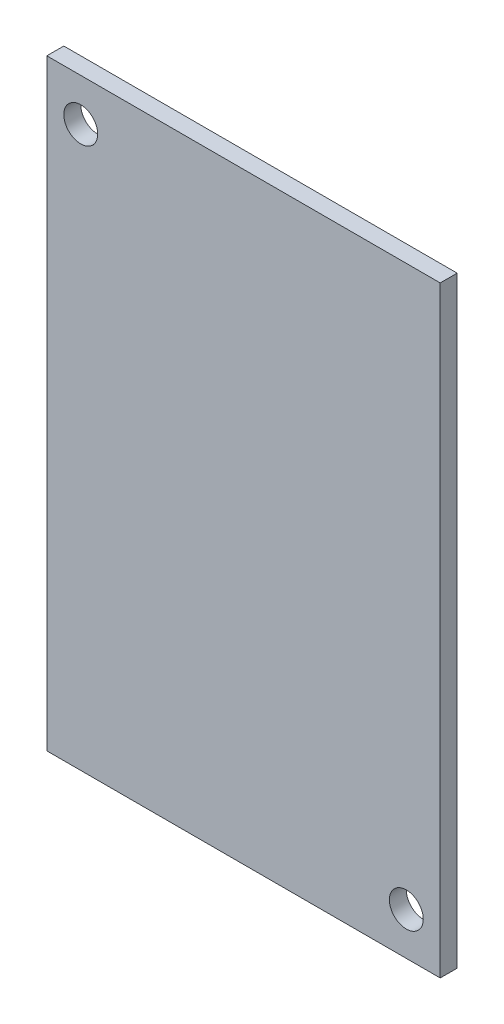
ISO-10303-21;
HEADER;
FILE_DESCRIPTION(('STEP AP214'),'2;1');
FILE_NAME('part.step','',(''),(''),'','','');
FILE_SCHEMA(('AUTOMOTIVE_DESIGN { 1 0 10303 214 1 1 1 1 }'));
ENDSEC;
DATA;
#1=APPLICATION_CONTEXT('core data for automotive mechanical design processes');
#2=APPLICATION_PROTOCOL_DEFINITION('international standard','automotive_design',2000,#1);
#3=PRODUCT_CONTEXT('',#1,'mechanical');
#4=PRODUCT('Part','Part','',(#3));
#5=PRODUCT_RELATED_PRODUCT_CATEGORY('part','',(#4));
#6=PRODUCT_DEFINITION_FORMATION('','',#4);
#7=PRODUCT_DEFINITION_CONTEXT('part definition',#1,'design');
#8=PRODUCT_DEFINITION('design','',#6,#7);
#9=PRODUCT_DEFINITION_SHAPE('','',#8);
#10=(LENGTH_UNIT() NAMED_UNIT(*) SI_UNIT(.MILLI.,.METRE.));
#11=(NAMED_UNIT(*) PLANE_ANGLE_UNIT() SI_UNIT($,.RADIAN.));
#12=(NAMED_UNIT(*) SI_UNIT($,.STERADIAN.) SOLID_ANGLE_UNIT());
#13=UNCERTAINTY_MEASURE_WITH_UNIT(LENGTH_MEASURE(1.E-05),#10,'distance_accuracy_value','');
#14=(GEOMETRIC_REPRESENTATION_CONTEXT(3) GLOBAL_UNCERTAINTY_ASSIGNED_CONTEXT((#13)) GLOBAL_UNIT_ASSIGNED_CONTEXT((#10,
#11,#12)) REPRESENTATION_CONTEXT('',''));
#15=CARTESIAN_POINT('',(0.,0.,0.));
#16=DIRECTION('',(0.,0.,1.));
#17=DIRECTION('',(1.,0.,0.));
#18=AXIS2_PLACEMENT_3D('',#15,#16,#17);
#19=CARTESIAN_POINT('',(-23.2,35.5,2.));
#20=DIRECTION('',(1.,0.,0.));
#21=DIRECTION('',(0.,1.,0.));
#22=AXIS2_PLACEMENT_3D('',#19,#20,#21);
#23=PLANE('',#22);
#24=DIRECTION('',(0.,-1.,0.));
#25=VECTOR('',#24,1.);
#26=CARTESIAN_POINT('',(-23.2,35.5,0.));
#27=LINE('',#26,#25);
#28=CARTESIAN_POINT('',(-23.2,35.5,0.));
#29=VERTEX_POINT('',#28);
#30=CARTESIAN_POINT('',(-23.2,-35.5,0.));
#31=VERTEX_POINT('',#30);
#32=EDGE_CURVE('E100',#29,#31,#27,.T.);
#33=ORIENTED_EDGE('',*,*,#32,.T.);
#34=DIRECTION('',(0.,0.,-1.));
#35=VECTOR('',#34,1.);
#36=CARTESIAN_POINT('',(-23.2,-35.5,2.));
#37=LINE('',#36,#35);
#38=CARTESIAN_POINT('',(-23.2,-35.5,2.));
#39=VERTEX_POINT('',#38);
#40=EDGE_CURVE('E11',#39,#31,#37,.T.);
#41=ORIENTED_EDGE('',*,*,#40,.F.);
#42=DIRECTION('',(0.,-1.,0.));
#43=VECTOR('',#42,1.);
#44=CARTESIAN_POINT('',(-23.2,35.5,2.));
#45=LINE('',#44,#43);
#46=CARTESIAN_POINT('',(-23.2,35.5,2.));
#47=VERTEX_POINT('',#46);
#48=EDGE_CURVE('E87',#47,#39,#45,.T.);
#49=ORIENTED_EDGE('',*,*,#48,.F.);
#50=DIRECTION('',(0.,0.,-1.));
#51=VECTOR('',#50,1.);
#52=CARTESIAN_POINT('',(-23.2,35.5,2.));
#53=LINE('',#52,#51);
#54=EDGE_CURVE('E96',#47,#29,#53,.T.);
#55=ORIENTED_EDGE('',*,*,#54,.T.);
#56=EDGE_LOOP('',(#33,#41,#49,#55));
#57=FACE_BOUND('',#56,.T.);
#58=ADVANCED_FACE('F36',(#57),#23,.F.);
#59=CARTESIAN_POINT('',(-23.2,-35.5,2.));
#60=DIRECTION('',(0.,1.,0.));
#61=DIRECTION('',(0.,0.,1.));
#62=AXIS2_PLACEMENT_3D('',#59,#60,#61);
#63=PLANE('',#62);
#64=DIRECTION('',(1.,0.,0.));
#65=VECTOR('',#64,1.);
#66=CARTESIAN_POINT('',(-23.2,-35.5,0.));
#67=LINE('',#66,#65);
#68=CARTESIAN_POINT('',(23.2,-35.5,0.));
#69=VERTEX_POINT('',#68);
#70=EDGE_CURVE('E91',#31,#69,#67,.T.);
#71=ORIENTED_EDGE('',*,*,#70,.T.);
#72=DIRECTION('',(0.,0.,-1.));
#73=VECTOR('',#72,1.);
#74=CARTESIAN_POINT('',(23.2,-35.5,2.));
#75=LINE('',#74,#73);
#76=CARTESIAN_POINT('',(23.2,-35.5,2.));
#77=VERTEX_POINT('',#76);
#78=EDGE_CURVE('E44',#77,#69,#75,.T.);
#79=ORIENTED_EDGE('',*,*,#78,.F.);
#80=DIRECTION('',(1.,0.,0.));
#81=VECTOR('',#80,1.);
#82=CARTESIAN_POINT('',(-23.2,-35.5,2.));
#83=LINE('',#82,#81);
#84=EDGE_CURVE('E82',#39,#77,#83,.T.);
#85=ORIENTED_EDGE('',*,*,#84,.F.);
#86=ORIENTED_EDGE('',*,*,#40,.T.);
#87=EDGE_LOOP('',(#71,#79,#85,#86));
#88=FACE_BOUND('',#87,.T.);
#89=ADVANCED_FACE('F90',(#88),#63,.F.);
#90=CARTESIAN_POINT('',(23.2,35.5,2.));
#91=DIRECTION('',(-1.,0.,0.));
#92=DIRECTION('',(0.,-1.,0.));
#93=AXIS2_PLACEMENT_3D('',#90,#91,#92);
#94=PLANE('',#93);
#95=DIRECTION('',(0.,1.,0.));
#96=VECTOR('',#95,1.);
#97=CARTESIAN_POINT('',(23.2,35.5,0.));
#98=LINE('',#97,#96);
#99=CARTESIAN_POINT('',(23.2,35.5,0.));
#100=VERTEX_POINT('',#99);
#101=EDGE_CURVE('E69',#69,#100,#98,.T.);
#102=ORIENTED_EDGE('',*,*,#101,.T.);
#103=DIRECTION('',(0.,0.,-1.));
#104=VECTOR('',#103,1.);
#105=CARTESIAN_POINT('',(23.2,35.5,2.));
#106=LINE('',#105,#104);
#107=CARTESIAN_POINT('',(23.2,35.5,2.));
#108=VERTEX_POINT('',#107);
#109=EDGE_CURVE('E92',#108,#100,#106,.T.);
#110=ORIENTED_EDGE('',*,*,#109,.F.);
#111=DIRECTION('',(0.,1.,0.));
#112=VECTOR('',#111,1.);
#113=CARTESIAN_POINT('',(23.2,35.5,2.));
#114=LINE('',#113,#112);
#115=EDGE_CURVE('E85',#77,#108,#114,.T.);
#116=ORIENTED_EDGE('',*,*,#115,.F.);
#117=ORIENTED_EDGE('',*,*,#78,.T.);
#118=EDGE_LOOP('',(#102,#110,#116,#117));
#119=FACE_BOUND('',#118,.T.);
#120=ADVANCED_FACE('F93',(#119),#94,.F.);
#121=CARTESIAN_POINT('',(-23.2,35.5,2.));
#122=DIRECTION('',(0.,-1.,0.));
#123=DIRECTION('',(0.,0.,-1.));
#124=AXIS2_PLACEMENT_3D('',#121,#122,#123);
#125=PLANE('',#124);
#126=DIRECTION('',(-1.,0.,0.));
#127=VECTOR('',#126,1.);
#128=CARTESIAN_POINT('',(-23.2,35.5,0.));
#129=LINE('',#128,#127);
#130=EDGE_CURVE('E75',#100,#29,#129,.T.);
#131=ORIENTED_EDGE('',*,*,#130,.T.);
#132=ORIENTED_EDGE('',*,*,#54,.F.);
#133=DIRECTION('',(-1.,0.,0.));
#134=VECTOR('',#133,1.);
#135=CARTESIAN_POINT('',(-23.2,35.5,2.));
#136=LINE('',#135,#134);
#137=EDGE_CURVE('E52',#108,#47,#136,.T.);
#138=ORIENTED_EDGE('',*,*,#137,.F.);
#139=ORIENTED_EDGE('',*,*,#109,.T.);
#140=EDGE_LOOP('',(#131,#132,#138,#139));
#141=FACE_BOUND('',#140,.T.);
#142=ADVANCED_FACE('F108',(#141),#125,.F.);
#143=CARTESIAN_POINT('',(-23.2,-35.5,2.));
#144=DIRECTION('',(0.,0.,1.));
#145=DIRECTION('',(1.,0.,0.));
#146=AXIS2_PLACEMENT_3D('',#143,#144,#145);
#147=PLANE('',#146);
#148=CARTESIAN_POINT('',(19.2,-30.5,2.));
#149=DIRECTION('',(0.,0.,1.));
#150=DIRECTION('',(1.,0.,0.));
#151=AXIS2_PLACEMENT_3D('',#148,#149,#150);
#152=CIRCLE('',#151,2.);
#153=CARTESIAN_POINT('',(21.2,-30.5,2.));
#154=VERTEX_POINT('',#153);
#155=EDGE_CURVE('E121',#154,#154,#152,.T.);
#156=ORIENTED_EDGE('',*,*,#155,.F.);
#157=EDGE_LOOP('',(#156));
#158=FACE_BOUND('',#157,.T.);
#159=CARTESIAN_POINT('',(-19.2,30.5,2.));
#160=DIRECTION('',(0.,0.,1.));
#161=DIRECTION('',(1.,0.,0.));
#162=AXIS2_PLACEMENT_3D('',#159,#160,#161);
#163=CIRCLE('',#162,2.);
#164=CARTESIAN_POINT('',(-17.2,30.5,2.));
#165=VERTEX_POINT('',#164);
#166=EDGE_CURVE('E114',#165,#165,#163,.T.);
#167=ORIENTED_EDGE('',*,*,#166,.F.);
#168=EDGE_LOOP('',(#167));
#169=FACE_BOUND('',#168,.T.);
#170=ORIENTED_EDGE('',*,*,#48,.T.);
#171=ORIENTED_EDGE('',*,*,#84,.T.);
#172=ORIENTED_EDGE('',*,*,#115,.T.);
#173=ORIENTED_EDGE('',*,*,#137,.T.);
#174=EDGE_LOOP('',(#170,#171,#172,#173));
#175=FACE_BOUND('',#174,.T.);
#176=ADVANCED_FACE('F83',(#158,#169,#175),#147,.T.);
#177=CARTESIAN_POINT('',(-23.2,-35.5,0.));
#178=DIRECTION('',(0.,0.,1.));
#179=DIRECTION('',(1.,0.,0.));
#180=AXIS2_PLACEMENT_3D('',#177,#178,#179);
#181=PLANE('',#180);
#182=CARTESIAN_POINT('',(19.2,-30.5,0.));
#183=DIRECTION('',(0.,0.,1.));
#184=DIRECTION('',(1.,0.,0.));
#185=AXIS2_PLACEMENT_3D('',#182,#183,#184);
#186=CIRCLE('',#185,2.);
#187=CARTESIAN_POINT('',(21.2,-30.5,0.));
#188=VERTEX_POINT('',#187);
#189=EDGE_CURVE('E117',#188,#188,#186,.T.);
#190=ORIENTED_EDGE('',*,*,#189,.T.);
#191=EDGE_LOOP('',(#190));
#192=FACE_BOUND('',#191,.T.);
#193=CARTESIAN_POINT('',(-19.2,30.5,0.));
#194=DIRECTION('',(0.,0.,1.));
#195=DIRECTION('',(1.,0.,0.));
#196=AXIS2_PLACEMENT_3D('',#193,#194,#195);
#197=CIRCLE('',#196,2.);
#198=CARTESIAN_POINT('',(-17.2,30.5,0.));
#199=VERTEX_POINT('',#198);
#200=EDGE_CURVE('E103',#199,#199,#197,.T.);
#201=ORIENTED_EDGE('',*,*,#200,.T.);
#202=EDGE_LOOP('',(#201));
#203=FACE_BOUND('',#202,.T.);
#204=ORIENTED_EDGE('',*,*,#32,.F.);
#205=ORIENTED_EDGE('',*,*,#130,.F.);
#206=ORIENTED_EDGE('',*,*,#101,.F.);
#207=ORIENTED_EDGE('',*,*,#70,.F.);
#208=EDGE_LOOP('',(#204,#205,#206,#207));
#209=FACE_BOUND('',#208,.T.);
#210=ADVANCED_FACE('F111',(#192,#203,#209),#181,.F.);
#211=CARTESIAN_POINT('',(-19.2,30.5,0.));
#212=DIRECTION('',(0.,0.,1.));
#213=DIRECTION('',(1.,0.,0.));
#214=AXIS2_PLACEMENT_3D('',#211,#212,#213);
#215=CYLINDRICAL_SURFACE('',#214,2.);
#216=ORIENTED_EDGE('',*,*,#200,.F.);
#217=EDGE_LOOP('',(#216));
#218=FACE_BOUND('',#217,.T.);
#219=ORIENTED_EDGE('',*,*,#166,.T.);
#220=EDGE_LOOP('',(#219));
#221=FACE_BOUND('',#220,.T.);
#222=ADVANCED_FACE('F132',(#218,#221),#215,.F.);
#223=CARTESIAN_POINT('',(19.2,-30.5,0.));
#224=DIRECTION('',(0.,0.,1.));
#225=DIRECTION('',(1.,0.,0.));
#226=AXIS2_PLACEMENT_3D('',#223,#224,#225);
#227=CYLINDRICAL_SURFACE('',#226,2.);
#228=ORIENTED_EDGE('',*,*,#189,.F.);
#229=EDGE_LOOP('',(#228));
#230=FACE_BOUND('',#229,.T.);
#231=ORIENTED_EDGE('',*,*,#155,.T.);
#232=EDGE_LOOP('',(#231));
#233=FACE_BOUND('',#232,.T.);
#234=ADVANCED_FACE('F129',(#230,#233),#227,.F.);
#235=CLOSED_SHELL('',(#58,#89,#120,#142,#176,#210,#222,#234));
#236=MANIFOLD_SOLID_BREP('B2',#235);
#237=ADVANCED_BREP_SHAPE_REPRESENTATION('',(#18,#236),#14);
#238=SHAPE_DEFINITION_REPRESENTATION(#9,#237);
ENDSEC;
END-ISO-10303-21;
